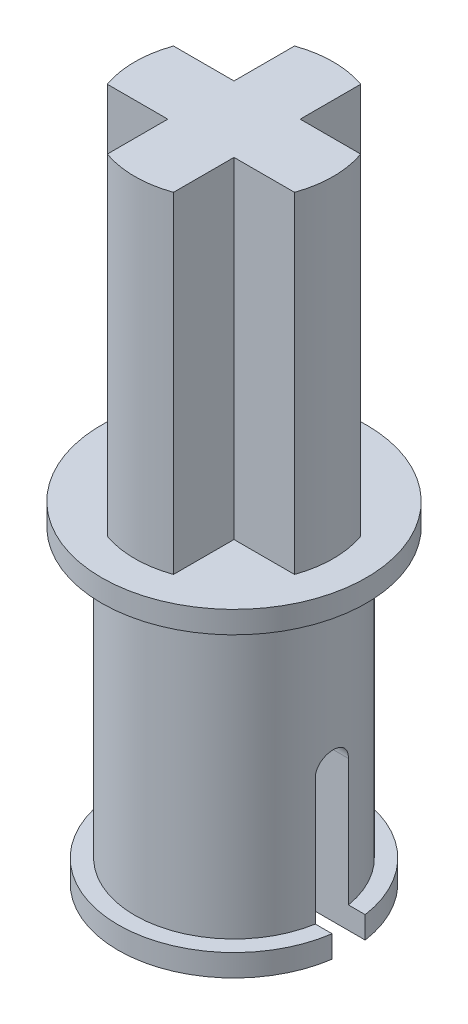
ISO-10303-21;
HEADER;
FILE_DESCRIPTION(('STEP AP214'),'2;1');
FILE_NAME('part.step','',(''),(''),'','','');
FILE_SCHEMA(('AUTOMOTIVE_DESIGN { 1 0 10303 214 1 1 1 1 }'));
ENDSEC;
DATA;
#1=APPLICATION_CONTEXT('core data for automotive mechanical design processes');
#2=APPLICATION_PROTOCOL_DEFINITION('international standard','automotive_design',2000,#1);
#3=PRODUCT_CONTEXT('',#1,'mechanical');
#4=PRODUCT('Part','Part','',(#3));
#5=PRODUCT_RELATED_PRODUCT_CATEGORY('part','',(#4));
#6=PRODUCT_DEFINITION_FORMATION('','',#4);
#7=PRODUCT_DEFINITION_CONTEXT('part definition',#1,'design');
#8=PRODUCT_DEFINITION('design','',#6,#7);
#9=PRODUCT_DEFINITION_SHAPE('','',#8);
#10=(LENGTH_UNIT() NAMED_UNIT(*) SI_UNIT(.MILLI.,.METRE.));
#11=(NAMED_UNIT(*) PLANE_ANGLE_UNIT() SI_UNIT($,.RADIAN.));
#12=(NAMED_UNIT(*) SI_UNIT($,.STERADIAN.) SOLID_ANGLE_UNIT());
#13=UNCERTAINTY_MEASURE_WITH_UNIT(LENGTH_MEASURE(1.E-05),#10,'distance_accuracy_value','');
#14=(GEOMETRIC_REPRESENTATION_CONTEXT(3) GLOBAL_UNCERTAINTY_ASSIGNED_CONTEXT((#13)) GLOBAL_UNIT_ASSIGNED_CONTEXT((#10,
#11,#12)) REPRESENTATION_CONTEXT('',''));
#15=CARTESIAN_POINT('',(0.,0.,0.));
#16=DIRECTION('',(0.,0.,1.));
#17=DIRECTION('',(1.,0.,0.));
#18=AXIS2_PLACEMENT_3D('',#15,#16,#17);
#19=CARTESIAN_POINT('',(0.,5.,0.));
#20=DIRECTION('',(0.,-1.,0.));
#21=DIRECTION('',(0.,0.,-1.));
#22=AXIS2_PLACEMENT_3D('',#19,#20,#21);
#23=CYLINDRICAL_SURFACE('',#22,1.5);
#24=CARTESIAN_POINT('',(0.,4.66666666666667,0.));
#25=DIRECTION('',(0.,1.,0.));
#26=DIRECTION('',(0.,0.,1.));
#27=AXIS2_PLACEMENT_3D('',#24,#25,#26);
#28=CIRCLE('',#27,1.5);
#29=CARTESIAN_POINT('',(0.,4.66666666666667,1.5));
#30=VERTEX_POINT('',#29);
#31=EDGE_CURVE('E418',#30,#30,#28,.T.);
#32=ORIENTED_EDGE('',*,*,#31,.F.);
#33=EDGE_LOOP('',(#32));
#34=FACE_BOUND('',#33,.T.);
#35=DIRECTION('',(0.,-1.,0.));
#36=VECTOR('',#35,1.);
#37=CARTESIAN_POINT('',(1.4790199457749,5.,0.250000000000003));
#38=LINE('',#37,#36);
#39=CARTESIAN_POINT('',(1.4790199457749,2.25,0.250000000000001));
#40=VERTEX_POINT('',#39);
#41=CARTESIAN_POINT('',(1.4790199457749,0.333333333333333,0.25));
#42=VERTEX_POINT('',#41);
#43=EDGE_CURVE('E342',#40,#42,#38,.T.);
#44=ORIENTED_EDGE('',*,*,#43,.F.);
#45=CARTESIAN_POINT('',(1.4790199457749,2.25,0.250000000000001));
#46=CARTESIAN_POINT('',(1.47901221872577,2.26396095683245,0.250012402551534));
#47=CARTESIAN_POINT('',(1.47921741048472,2.27791611938485,0.248831345018213));
#48=CARTESIAN_POINT('',(1.47999587227818,2.30541016199332,0.244176500369213));
#49=CARTESIAN_POINT('',(1.48056865919225,2.31894956403438,0.240705722404357));
#50=CARTESIAN_POINT('',(1.48202499235243,2.34524892864396,0.231564174181125));
#51=CARTESIAN_POINT('',(1.48290860685375,2.35800871929328,0.225892920688047));
#52=CARTESIAN_POINT('',(1.48488428816452,2.38239648919483,0.212519368982266));
#53=CARTESIAN_POINT('',(1.48597635768617,2.39402445371803,0.204817044343013));
#54=CARTESIAN_POINT('',(1.4882583756911,2.41593080757023,0.187519228628307));
#55=CARTESIAN_POINT('',(1.48944909400201,2.42619655698689,0.177907829040405));
#56=CARTESIAN_POINT('',(1.491787383604,2.44497851689128,0.157098237376144));
#57=CARTESIAN_POINT('',(1.49293494825854,2.45349445917116,0.145899802485204));
#58=CARTESIAN_POINT('',(1.49506576447851,2.46858167581452,0.122151951774289));
#59=CARTESIAN_POINT('',(1.49604799754859,2.47514107555226,0.109594892662244));
#60=CARTESIAN_POINT('',(1.49772877775239,2.4860523548294,0.0835387910448557));
#61=CARTESIAN_POINT('',(1.49842735944605,2.49040450331528,0.0700398635312756));
#62=CARTESIAN_POINT('',(1.49945672837495,2.49673921602822,0.0426145358003457));
#63=CARTESIAN_POINT('',(1.49979084515831,2.49874324410422,0.0286932203419586));
#64=CARTESIAN_POINT('',(1.50006508076469,2.50039158366326,0.000707863169417902));
#65=CARTESIAN_POINT('',(1.50000521702303,2.50003599956928,-0.0133561722012632));
#66=CARTESIAN_POINT('',(1.49950085758421,2.49699186011671,-0.0410802628902763));
#67=CARTESIAN_POINT('',(1.49906018069639,2.49432646686981,-0.0547429408470389));
#68=CARTESIAN_POINT('',(1.49784797400948,2.48677486104158,-0.0814242809166844));
#69=CARTESIAN_POINT('',(1.49707643624335,2.48188859498202,-0.0944429275130362));
#70=CARTESIAN_POINT('',(1.49528268120945,2.4700108264475,-0.119535849696669));
#71=CARTESIAN_POINT('',(1.49425932707671,2.46300974272845,-0.13160550541869));
#72=CARTESIAN_POINT('',(1.49207569682498,2.44710838032663,-0.154406950855712));
#73=CARTESIAN_POINT('',(1.49091541471556,2.43820801853899,-0.165138681995881));
#74=CARTESIAN_POINT('',(1.48857042314863,2.41863349651485,-0.185095754958703));
#75=CARTESIAN_POINT('',(1.48738558768296,2.40793931445142,-0.194301454502454));
#76=CARTESIAN_POINT('',(1.48513828313712,2.38514456844212,-0.210793395600476));
#77=CARTESIAN_POINT('',(1.48407584899365,2.37304360493252,-0.218079089892692));
#78=CARTESIAN_POINT('',(1.48219297916677,2.34775214208037,-0.230529023100573));
#79=CARTESIAN_POINT('',(1.48137295536583,2.33455983653606,-0.235689657078122));
#80=CARTESIAN_POINT('',(1.48007591486501,2.3074944232718,-0.243706410032311));
#81=CARTESIAN_POINT('',(1.47959838545312,2.29362236653597,-0.246565974481917));
#82=CARTESIAN_POINT('',(1.47911853225327,2.26978500932565,-0.249414284585125));
#83=CARTESIAN_POINT('',(1.47901686648485,2.25989054232892,-0.250005433378814));
#84=CARTESIAN_POINT('',(1.47901994577491,2.25,-0.25));
#85=B_SPLINE_CURVE_WITH_KNOTS('',3,(#45,#46,#47,#48,#49,#50,#51,#52,#53,#54,#55,#56,#57,#58,#59,
#60,#61,#62,#63,#64,#65,#66,#67,#68,#69,#70,#71,#72,#73,#74,#75,#76,#77,#78,#79,#80,#81,#82,#83,
#84),.UNSPECIFIED.,.F.,.F.,(4,2,2,2,2,2,2,2,2,2,2,2,2,2,2,2,2,2,2,4),(0.,0.0418228026426395,
0.083590750953894,0.125367876897847,0.167145546436639,0.209287179345357,0.251435266850383,
0.293834184215328,0.336227934166392,0.378231068338879,0.420232343704392,0.461817252795841,
0.503403163297524,0.54518038008816,0.586959425258929,0.629240298269244,0.671533209659102,
0.71389757379739,0.756198385617119,0.785863044728452),.UNSPECIFIED.);
#86=CARTESIAN_POINT('',(1.4790199457749,2.25,-0.25));
#87=VERTEX_POINT('',#86);
#88=EDGE_CURVE('E350',#40,#87,#85,.T.);
#89=ORIENTED_EDGE('',*,*,#88,.T.);
#90=DIRECTION('',(0.,-1.,0.));
#91=VECTOR('',#90,1.);
#92=CARTESIAN_POINT('',(1.4790199457749,5.,-0.25));
#93=LINE('',#92,#91);
#94=CARTESIAN_POINT('',(1.4790199457749,0.333333333333333,-0.25));
#95=VERTEX_POINT('',#94);
#96=EDGE_CURVE('E322',#87,#95,#93,.T.);
#97=ORIENTED_EDGE('',*,*,#96,.T.);
#98=CARTESIAN_POINT('',(0.,0.333333333333333,0.));
#99=DIRECTION('',(0.,-1.,0.));
#100=DIRECTION('',(0.,0.,-1.));
#101=AXIS2_PLACEMENT_3D('',#98,#99,#100);
#102=CIRCLE('',#101,1.5);
#103=CARTESIAN_POINT('',(-1.4790199457749,0.333333333333333,-0.25));
#104=VERTEX_POINT('',#103);
#105=EDGE_CURVE('E443',#104,#95,#102,.T.);
#106=ORIENTED_EDGE('',*,*,#105,.F.);
#107=DIRECTION('',(0.,-1.,0.));
#108=VECTOR('',#107,1.);
#109=CARTESIAN_POINT('',(-1.4790199457749,5.,-0.25));
#110=LINE('',#109,#108);
#111=CARTESIAN_POINT('',(-1.4790199457749,2.25,-0.25));
#112=VERTEX_POINT('',#111);
#113=EDGE_CURVE('E316',#104,#112,#110,.F.);
#114=ORIENTED_EDGE('',*,*,#113,.T.);
#115=CARTESIAN_POINT('',(-1.4790199457749,2.25,-0.25));
#116=CARTESIAN_POINT('',(-1.47901221872577,2.26396095683244,-0.250012402551532));
#117=CARTESIAN_POINT('',(-1.47921741048472,2.27791611938485,-0.248831345018212));
#118=CARTESIAN_POINT('',(-1.47999587227818,2.30541016199332,-0.244176500369212));
#119=CARTESIAN_POINT('',(-1.48056865919225,2.31894956403438,-0.240705722404356));
#120=CARTESIAN_POINT('',(-1.48202499235243,2.34524892864396,-0.231564174181124));
#121=CARTESIAN_POINT('',(-1.48290860685375,2.35800871929328,-0.225892920688045));
#122=CARTESIAN_POINT('',(-1.48488428816452,2.38239648919483,-0.212519368982264));
#123=CARTESIAN_POINT('',(-1.48597635768617,2.39402445371803,-0.204817044343012));
#124=CARTESIAN_POINT('',(-1.4882583756911,2.41593080757023,-0.187519228628305));
#125=CARTESIAN_POINT('',(-1.48944909400201,2.42619655698689,-0.177907829040403));
#126=CARTESIAN_POINT('',(-1.491787383604,2.44497851689128,-0.157098237376143));
#127=CARTESIAN_POINT('',(-1.49293494825854,2.45349445917116,-0.145899802485202));
#128=CARTESIAN_POINT('',(-1.49506576447851,2.46858167581452,-0.122151951774287));
#129=CARTESIAN_POINT('',(-1.49604799754859,2.47514107555226,-0.109594892662243));
#130=CARTESIAN_POINT('',(-1.49772877775239,2.4860523548294,-0.0835387910448543));
#131=CARTESIAN_POINT('',(-1.49842735944605,2.49040450331528,-0.0700398635312742));
#132=CARTESIAN_POINT('',(-1.49945672837495,2.49673921602822,-0.0426145358003443));
#133=CARTESIAN_POINT('',(-1.49979084515831,2.49874324410422,-0.0286932203419571));
#134=CARTESIAN_POINT('',(-1.50006508076469,2.50039158366326,-0.000707863169416467));
#135=CARTESIAN_POINT('',(-1.50000521702303,2.50003599956928,0.0133561722012646));
#136=CARTESIAN_POINT('',(-1.49950085758421,2.49699186011671,0.0410802628902777));
#137=CARTESIAN_POINT('',(-1.49906018069639,2.49432646686981,0.0547429408470403));
#138=CARTESIAN_POINT('',(-1.49784797400948,2.48677486104158,0.0814242809166857));
#139=CARTESIAN_POINT('',(-1.49707643624335,2.48188859498202,0.0944429275130376));
#140=CARTESIAN_POINT('',(-1.49528268120945,2.4700108264475,0.11953584969667));
#141=CARTESIAN_POINT('',(-1.49425932707671,2.46300974272845,0.131605505418692));
#142=CARTESIAN_POINT('',(-1.49207569682498,2.44710838032663,0.154406950855713));
#143=CARTESIAN_POINT('',(-1.49091541471556,2.43820801853899,0.165138681995883));
#144=CARTESIAN_POINT('',(-1.48857042314863,2.41863349651485,0.185095754958704));
#145=CARTESIAN_POINT('',(-1.48738558768296,2.40793931445142,0.194301454502455));
#146=CARTESIAN_POINT('',(-1.48513828313712,2.38514456844212,0.210793395600477));
#147=CARTESIAN_POINT('',(-1.48407584899365,2.37304360493252,0.218079089892694));
#148=CARTESIAN_POINT('',(-1.48219297916677,2.34775214208037,0.230529023100574));
#149=CARTESIAN_POINT('',(-1.48137295536583,2.33455983653606,0.235689657078123));
#150=CARTESIAN_POINT('',(-1.48007591486501,2.3074944232718,0.243706410032312));
#151=CARTESIAN_POINT('',(-1.47959838545312,2.29362236653597,0.246565974481918));
#152=CARTESIAN_POINT('',(-1.47911853225327,2.26978500932565,0.249414284585126));
#153=CARTESIAN_POINT('',(-1.47901686648485,2.25989054232892,0.250005433378815));
#154=CARTESIAN_POINT('',(-1.47901994577491,2.25,0.250000000000002));
#155=B_SPLINE_CURVE_WITH_KNOTS('',3,(#115,#116,#117,#118,#119,#120,#121,#122,#123,#124,#125,
#126,#127,#128,#129,#130,#131,#132,#133,#134,#135,#136,#137,#138,#139,#140,#141,#142,#143,#144,
#145,#146,#147,#148,#149,#150,#151,#152,#153,#154),.UNSPECIFIED.,.F.,.F.,(4,2,2,2,2,2,2,2,2,2,2,
2,2,2,2,2,2,2,2,4),(0.,0.0418228026426391,0.083590750953894,0.125367876897847,0.167145546436639,
0.209287179345357,0.251435266850383,0.293834184215328,0.336227934166392,0.378231068338879,
0.420232343704392,0.461817252795841,0.503403163297524,0.54518038008816,0.586959425258928,
0.629240298269243,0.671533209659102,0.71389757379739,0.756198385617119,0.785863044728452),.UNSPECIFIED.);
#156=CARTESIAN_POINT('',(-1.4790199457749,2.25,0.250000000000001));
#157=VERTEX_POINT('',#156);
#158=EDGE_CURVE('E344',#112,#157,#155,.T.);
#159=ORIENTED_EDGE('',*,*,#158,.T.);
#160=DIRECTION('',(0.,-1.,0.));
#161=VECTOR('',#160,1.);
#162=CARTESIAN_POINT('',(-1.4790199457749,5.,0.250000000000003));
#163=LINE('',#162,#161);
#164=CARTESIAN_POINT('',(-1.4790199457749,0.333333333333333,0.25));
#165=VERTEX_POINT('',#164);
#166=EDGE_CURVE('E336',#165,#157,#163,.F.);
#167=ORIENTED_EDGE('',*,*,#166,.F.);
#168=EDGE_CURVE('E424',#42,#165,#102,.T.);
#169=ORIENTED_EDGE('',*,*,#168,.F.);
#170=EDGE_LOOP('',(#44,#89,#97,#106,#114,#159,#167,#169));
#171=FACE_BOUND('',#170,.T.);
#172=ADVANCED_FACE('F35',(#34,#171),#23,.T.);
#173=CARTESIAN_POINT('',(0.,0.333333333333333,0.));
#174=DIRECTION('',(0.,-1.,0.));
#175=DIRECTION('',(0.,0.,-1.));
#176=AXIS2_PLACEMENT_3D('',#173,#174,#175);
#177=PLANE('',#176);
#178=DIRECTION('',(1.,0.,0.));
#179=VECTOR('',#178,1.);
#180=CARTESIAN_POINT('',(0.,0.333333333333333,0.25));
#181=LINE('',#180,#179);
#182=CARTESIAN_POINT('',(-1.73205080756888,0.333333333333333,0.25));
#183=VERTEX_POINT('',#182);
#184=EDGE_CURVE('E334',#183,#165,#181,.T.);
#185=ORIENTED_EDGE('',*,*,#184,.F.);
#186=CARTESIAN_POINT('',(0.,0.333333333333333,0.));
#187=DIRECTION('',(0.,-1.,0.));
#188=DIRECTION('',(0.,0.,-1.));
#189=AXIS2_PLACEMENT_3D('',#186,#187,#188);
#190=CIRCLE('',#189,1.75);
#191=CARTESIAN_POINT('',(1.73205080756888,0.333333333333333,0.25));
#192=VERTEX_POINT('',#191);
#193=EDGE_CURVE('E431',#192,#183,#190,.T.);
#194=ORIENTED_EDGE('',*,*,#193,.F.);
#195=EDGE_CURVE('E337',#42,#192,#181,.T.);
#196=ORIENTED_EDGE('',*,*,#195,.F.);
#197=ORIENTED_EDGE('',*,*,#168,.T.);
#198=EDGE_LOOP('',(#185,#194,#196,#197));
#199=FACE_BOUND('',#198,.T.);
#200=ADVANCED_FACE('F408',(#199),#177,.F.);
#201=CARTESIAN_POINT('',(0.,0.333333333333333,0.));
#202=DIRECTION('',(0.,-1.,0.));
#203=DIRECTION('',(0.,0.,-1.));
#204=AXIS2_PLACEMENT_3D('',#201,#202,#203);
#205=CYLINDRICAL_SURFACE('',#204,1.75);
#206=CARTESIAN_POINT('',(0.,0.,0.));
#207=DIRECTION('',(0.,-1.,0.));
#208=DIRECTION('',(0.,0.,-1.));
#209=AXIS2_PLACEMENT_3D('',#206,#207,#208);
#210=CIRCLE('',#209,1.75);
#211=CARTESIAN_POINT('',(1.73205080756888,0.,0.25));
#212=VERTEX_POINT('',#211);
#213=CARTESIAN_POINT('',(-1.73205080756888,0.,0.25));
#214=VERTEX_POINT('',#213);
#215=EDGE_CURVE('E439',#212,#214,#210,.T.);
#216=ORIENTED_EDGE('',*,*,#215,.F.);
#217=DIRECTION('',(0.,-1.,0.));
#218=VECTOR('',#217,1.);
#219=CARTESIAN_POINT('',(1.73205080756888,0.333333333333333,0.25));
#220=LINE('',#219,#218);
#221=EDGE_CURVE('E339',#212,#192,#220,.F.);
#222=ORIENTED_EDGE('',*,*,#221,.T.);
#223=ORIENTED_EDGE('',*,*,#193,.T.);
#224=DIRECTION('',(0.,-1.,0.));
#225=VECTOR('',#224,1.);
#226=CARTESIAN_POINT('',(-1.73205080756888,0.333333333333333,0.25));
#227=LINE('',#226,#225);
#228=EDGE_CURVE('E331',#183,#214,#227,.T.);
#229=ORIENTED_EDGE('',*,*,#228,.T.);
#230=EDGE_LOOP('',(#216,#222,#223,#229));
#231=FACE_BOUND('',#230,.T.);
#232=ADVANCED_FACE('F382',(#231),#205,.T.);
#233=CARTESIAN_POINT('',(0.,5.,0.));
#234=DIRECTION('',(0.,-1.,0.));
#235=DIRECTION('',(0.,0.,-1.));
#236=AXIS2_PLACEMENT_3D('',#233,#234,#235);
#237=CYLINDRICAL_SURFACE('',#236,1.);
#238=CARTESIAN_POINT('',(0.,4.66666666666667,0.));
#239=DIRECTION('',(0.,1.,0.));
#240=DIRECTION('',(0.,0.,1.));
#241=AXIS2_PLACEMENT_3D('',#238,#239,#240);
#242=CIRCLE('',#241,1.);
#243=CARTESIAN_POINT('',(0.,4.66666666666667,1.));
#244=VERTEX_POINT('',#243);
#245=EDGE_CURVE('E447',#244,#244,#242,.T.);
#246=ORIENTED_EDGE('',*,*,#245,.T.);
#247=EDGE_LOOP('',(#246));
#248=FACE_BOUND('',#247,.T.);
#249=CARTESIAN_POINT('',(0.968245836551854,2.25,0.250000000000001));
#250=CARTESIAN_POINT('',(0.968234049545617,2.26383070607813,0.250012953215812));
#251=CARTESIAN_POINT('',(0.968541877962347,2.27765275214075,0.248853161388951));
#252=CARTESIAN_POINT('',(0.969707324249105,2.30486994361927,0.244289832798707));
#253=CARTESIAN_POINT('',(0.970563824163099,2.31826589909795,0.240890858126017));
#254=CARTESIAN_POINT('',(0.9727377402555,2.344279386634,0.231950584629504));
#255=CARTESIAN_POINT('',(0.974055113119327,2.35689699171264,0.226409487125331));
#256=CARTESIAN_POINT('',(0.976998055593671,2.38102834005615,0.213353558724009));
#257=CARTESIAN_POINT('',(0.978623707814904,2.39254178618752,0.205838198568215));
#258=CARTESIAN_POINT('',(0.982040595501114,2.41438583871804,0.18887119674902));
#259=CARTESIAN_POINT('',(0.983834461354369,2.42468868623804,0.17938433831947));
#260=CARTESIAN_POINT('',(0.987362777210994,2.44357555769966,0.158818924002211));
#261=CARTESIAN_POINT('',(0.989097217680292,2.45215930689364,0.147740114172738));
#262=CARTESIAN_POINT('',(0.992340451273177,2.46747774074516,0.124114230626838));
#263=CARTESIAN_POINT('',(0.993845760516911,2.47418497140975,0.111548836630203));
#264=CARTESIAN_POINT('',(0.996430866813653,2.48538118613491,0.0854256461644529));
#265=CARTESIAN_POINT('',(0.997510747601812,2.48987060676118,0.0718680456103894));
#266=CARTESIAN_POINT('',(0.999104749704138,2.49641474752203,0.0444360275333476));
#267=CARTESIAN_POINT('',(0.999629882170623,2.4985169179257,0.030573580608359));
#268=CARTESIAN_POINT('',(1.00009359545966,2.50037584306581,0.00268319381279078));
#269=CARTESIAN_POINT('',(1.00003225000546,2.50013289259581,-0.0113447250357131));
#270=CARTESIAN_POINT('',(0.999338093392974,2.49734250903197,-0.0388381232151192));
#271=CARTESIAN_POINT('',(0.99871799668788,2.49484634583761,-0.0523091754274905));
#272=CARTESIAN_POINT('',(0.996990826596762,2.48770283021684,-0.0786346777785571));
#273=CARTESIAN_POINT('',(0.995883731664611,2.48305538261128,-0.0914891006079816));
#274=CARTESIAN_POINT('',(0.993287494403769,2.47169967982888,-0.116351821504131));
#275=CARTESIAN_POINT('',(0.991794984571589,2.46497315144064,-0.128351407400121));
#276=CARTESIAN_POINT('',(0.988589863852097,2.44966421754278,-0.151069157807944));
#277=CARTESIAN_POINT('',(0.986877219821464,2.44108153243782,-0.161787128890331));
#278=CARTESIAN_POINT('',(0.983363915069006,2.42203027197852,-0.181942347427369));
#279=CARTESIAN_POINT('',(0.981562126239374,2.41151709086156,-0.191337275764997));
#280=CARTESIAN_POINT('',(0.978115420664843,2.38904253327155,-0.208242393795092));
#281=CARTESIAN_POINT('',(0.976470546938616,2.37708076169189,-0.215752067555646));
#282=CARTESIAN_POINT('',(0.973519534135929,2.3519636005341,-0.228701177325652));
#283=CARTESIAN_POINT('',(0.972215265658711,2.338802133734,-0.234129254490506));
#284=CARTESIAN_POINT('',(0.970117647619827,2.31172076785364,-0.242675587980693));
#285=CARTESIAN_POINT('',(0.969323534507774,2.29780203620287,-0.24579729730641));
#286=CARTESIAN_POINT('',(0.968638226662377,2.27813565481264,-0.248476158786593));
#287=CARTESIAN_POINT('',(0.968491307756439,2.27252007419789,-0.249047697741106));
#288=CARTESIAN_POINT('',(0.968295156243113,2.26127055252149,-0.249809189424918));
#289=CARTESIAN_POINT('',(0.968245765589992,2.25563665600881,-0.249999759525152));
#290=CARTESIAN_POINT('',(0.968245836551973,2.25,-0.250000000000009));
#291=B_SPLINE_CURVE_WITH_KNOTS('',3,(#249,#250,#251,#252,#253,#254,#255,#256,#257,#258,#259,
#260,#261,#262,#263,#264,#265,#266,#267,#268,#269,#270,#271,#272,#273,#274,#275,#276,#277,#278,
#279,#280,#281,#282,#283,#284,#285,#286,#287,#288,#289,#290),.UNSPECIFIED.,.F.,.F.,(4,2,2,2,2,2,
2,2,2,2,2,2,2,2,2,2,2,2,2,2,4),(0.,0.0414268569974913,0.0827695712464079,0.124108400994361,
0.165458324149683,0.207622554824989,0.249793518852794,0.292552548213583,0.335303157299057,
0.377188284256308,0.419068146109594,0.460018444166185,0.500970554157592,0.542293354093937,
0.583622382878818,0.626065654304352,0.668520528420415,0.711203880860888,0.753823199296981,
0.770751702253638,0.787652749776197),.UNSPECIFIED.);
#292=CARTESIAN_POINT('',(0.968245836551853,2.25,0.250000000000001));
#293=VERTEX_POINT('',#292);
#294=CARTESIAN_POINT('',(0.968245836551854,2.25,-0.25));
#295=VERTEX_POINT('',#294);
#296=EDGE_CURVE('E11',#293,#295,#291,.T.);
#297=ORIENTED_EDGE('',*,*,#296,.F.);
#298=DIRECTION('',(0.,-1.,0.));
#299=VECTOR('',#298,1.);
#300=CARTESIAN_POINT('',(0.968245836551853,5.,0.250000000000003));
#301=LINE('',#300,#299);
#302=CARTESIAN_POINT('',(0.968245836551854,0.,0.25));
#303=VERTEX_POINT('',#302);
#304=EDGE_CURVE('E328',#293,#303,#301,.T.);
#305=ORIENTED_EDGE('',*,*,#304,.T.);
#306=CARTESIAN_POINT('',(0.,0.,0.));
#307=DIRECTION('',(0.,1.,0.));
#308=DIRECTION('',(0.,0.,1.));
#309=AXIS2_PLACEMENT_3D('',#306,#307,#308);
#310=CIRCLE('',#309,1.);
#311=CARTESIAN_POINT('',(-0.968245836551854,0.,0.25));
#312=VERTEX_POINT('',#311);
#313=EDGE_CURVE('E451',#312,#303,#310,.T.);
#314=ORIENTED_EDGE('',*,*,#313,.F.);
#315=DIRECTION('',(0.,-1.,0.));
#316=VECTOR('',#315,1.);
#317=CARTESIAN_POINT('',(-0.968245836551853,5.,0.250000000000003));
#318=LINE('',#317,#316);
#319=CARTESIAN_POINT('',(-0.968245836551853,2.25,0.250000000000001));
#320=VERTEX_POINT('',#319);
#321=EDGE_CURVE('E325',#312,#320,#318,.F.);
#322=ORIENTED_EDGE('',*,*,#321,.T.);
#323=CARTESIAN_POINT('',(-0.968245836551854,2.25,-0.25));
#324=CARTESIAN_POINT('',(-0.968234049545618,2.26383070607813,-0.250012953215811));
#325=CARTESIAN_POINT('',(-0.968541877962347,2.27765275214075,-0.24885316138895));
#326=CARTESIAN_POINT('',(-0.969707324249105,2.30486994361927,-0.244289832798706));
#327=CARTESIAN_POINT('',(-0.970563824163099,2.31826589909795,-0.240890858126015));
#328=CARTESIAN_POINT('',(-0.9727377402555,2.344279386634,-0.231950584629502));
#329=CARTESIAN_POINT('',(-0.974055113119327,2.35689699171264,-0.22640948712533));
#330=CARTESIAN_POINT('',(-0.976998055593672,2.38102834005615,-0.213353558724008));
#331=CARTESIAN_POINT('',(-0.978623707814904,2.39254178618752,-0.205838198568213));
#332=CARTESIAN_POINT('',(-0.982040595501114,2.41438583871804,-0.188871196749019));
#333=CARTESIAN_POINT('',(-0.983834461354369,2.42468868623804,-0.179384338319469));
#334=CARTESIAN_POINT('',(-0.987362777210994,2.44357555769966,-0.15881892400221));
#335=CARTESIAN_POINT('',(-0.989097217680292,2.45215930689364,-0.147740114172737));
#336=CARTESIAN_POINT('',(-0.992340451273177,2.46747774074516,-0.124114230626837));
#337=CARTESIAN_POINT('',(-0.993845760516911,2.47418497140975,-0.111548836630201));
#338=CARTESIAN_POINT('',(-0.996430866813653,2.48538118613491,-0.0854256461644516));
#339=CARTESIAN_POINT('',(-0.997510747601812,2.48987060676118,-0.071868045610388));
#340=CARTESIAN_POINT('',(-0.999104749704139,2.49641474752203,-0.0444360275333462));
#341=CARTESIAN_POINT('',(-0.999629882170623,2.4985169179257,-0.0305735806083575));
#342=CARTESIAN_POINT('',(-1.00009359545966,2.50037584306581,-0.00268319381278935));
#343=CARTESIAN_POINT('',(-1.00003225000546,2.50013289259581,0.0113447250357145));
#344=CARTESIAN_POINT('',(-0.999338093392974,2.49734250903197,0.0388381232151207));
#345=CARTESIAN_POINT('',(-0.99871799668788,2.49484634583761,0.052309175427492));
#346=CARTESIAN_POINT('',(-0.996990826596762,2.48770283021684,0.0786346777785586));
#347=CARTESIAN_POINT('',(-0.995883731664611,2.48305538261128,0.091489100607983));
#348=CARTESIAN_POINT('',(-0.993287494403768,2.47169967982888,0.116351821504132));
#349=CARTESIAN_POINT('',(-0.991794984571589,2.46497315144064,0.128351407400122));
#350=CARTESIAN_POINT('',(-0.988589863852097,2.44966421754278,0.151069157807945));
#351=CARTESIAN_POINT('',(-0.986877219821464,2.44108153243782,0.161787128890333));
#352=CARTESIAN_POINT('',(-0.983363915069006,2.42203027197852,0.18194234742737));
#353=CARTESIAN_POINT('',(-0.981562126239374,2.41151709086156,0.191337275764998));
#354=CARTESIAN_POINT('',(-0.978115420664843,2.38904253327155,0.208242393795094));
#355=CARTESIAN_POINT('',(-0.976470546938616,2.37708076169189,0.215752067555647));
#356=CARTESIAN_POINT('',(-0.973519534135928,2.3519636005341,0.228701177325654));
#357=CARTESIAN_POINT('',(-0.972215265658711,2.338802133734,0.234129254490508));
#358=CARTESIAN_POINT('',(-0.970117647619827,2.31172076785364,0.242675587980694));
#359=CARTESIAN_POINT('',(-0.969323534507774,2.29780203620287,0.245797297306411));
#360=CARTESIAN_POINT('',(-0.968638226662376,2.27813565481264,0.248476158786595));
#361=CARTESIAN_POINT('',(-0.968491307756439,2.27252007419789,0.249047697741108));
#362=CARTESIAN_POINT('',(-0.968295156243113,2.26127055252149,0.24980918942492));
#363=CARTESIAN_POINT('',(-0.968245765589992,2.25563665600881,0.249999759525153));
#364=CARTESIAN_POINT('',(-0.968245836551973,2.25,0.25000000000001));
#365=B_SPLINE_CURVE_WITH_KNOTS('',3,(#323,#324,#325,#326,#327,#328,#329,#330,#331,#332,#333,
#334,#335,#336,#337,#338,#339,#340,#341,#342,#343,#344,#345,#346,#347,#348,#349,#350,#351,#352,
#353,#354,#355,#356,#357,#358,#359,#360,#361,#362,#363,#364),.UNSPECIFIED.,.F.,.F.,(4,2,2,2,2,2,
2,2,2,2,2,2,2,2,2,2,2,2,2,2,4),(0.,0.0414268569974913,0.0827695712464079,0.124108400994361,
0.165458324149683,0.207622554824989,0.249793518852794,0.292552548213582,0.335303157299057,
0.377188284256308,0.419068146109593,0.460018444166185,0.500970554157592,0.542293354093937,
0.583622382878818,0.626065654304352,0.668520528420415,0.711203880860888,0.753823199296981,
0.770751702253638,0.787652749776197),.UNSPECIFIED.);
#366=CARTESIAN_POINT('',(-0.968245836551854,2.25,-0.25));
#367=VERTEX_POINT('',#366);
#368=EDGE_CURVE('E48',#367,#320,#365,.T.);
#369=ORIENTED_EDGE('',*,*,#368,.F.);
#370=DIRECTION('',(0.,-1.,0.));
#371=VECTOR('',#370,1.);
#372=CARTESIAN_POINT('',(-0.968245836551854,5.,-0.25));
#373=LINE('',#372,#371);
#374=CARTESIAN_POINT('',(-0.968245836551854,0.,-0.25));
#375=VERTEX_POINT('',#374);
#376=EDGE_CURVE('E307',#375,#367,#373,.F.);
#377=ORIENTED_EDGE('',*,*,#376,.F.);
#378=CARTESIAN_POINT('',(0.968245836551854,0.,-0.25));
#379=VERTEX_POINT('',#378);
#380=EDGE_CURVE('E450',#379,#375,#310,.T.);
#381=ORIENTED_EDGE('',*,*,#380,.F.);
#382=DIRECTION('',(0.,-1.,0.));
#383=VECTOR('',#382,1.);
#384=CARTESIAN_POINT('',(0.968245836551854,5.,-0.25));
#385=LINE('',#384,#383);
#386=EDGE_CURVE('E309',#295,#379,#385,.T.);
#387=ORIENTED_EDGE('',*,*,#386,.F.);
#388=EDGE_LOOP('',(#297,#305,#314,#322,#369,#377,#381,#387));
#389=FACE_BOUND('',#388,.T.);
#390=ADVANCED_FACE('F376',(#248,#389),#237,.F.);
#391=CARTESIAN_POINT('',(0.,0.,0.));
#392=DIRECTION('',(0.,1.,0.));
#393=DIRECTION('',(0.,0.,1.));
#394=AXIS2_PLACEMENT_3D('',#391,#392,#393);
#395=PLANE('',#394);
#396=DIRECTION('',(-1.,0.,0.));
#397=VECTOR('',#396,1.);
#398=CARTESIAN_POINT('',(0.,0.,0.25));
#399=LINE('',#398,#397);
#400=EDGE_CURVE('E373',#212,#303,#399,.T.);
#401=ORIENTED_EDGE('',*,*,#400,.F.);
#402=ORIENTED_EDGE('',*,*,#215,.T.);
#403=EDGE_CURVE('E374',#312,#214,#399,.T.);
#404=ORIENTED_EDGE('',*,*,#403,.F.);
#405=ORIENTED_EDGE('',*,*,#313,.T.);
#406=EDGE_LOOP('',(#401,#402,#404,#405));
#407=FACE_BOUND('',#406,.T.);
#408=ADVANCED_FACE('F381',(#407),#395,.F.);
#409=CARTESIAN_POINT('',(0.,4.66666666666667,0.));
#410=DIRECTION('',(0.,1.,0.));
#411=DIRECTION('',(0.,0.,1.));
#412=AXIS2_PLACEMENT_3D('',#409,#410,#411);
#413=CYLINDRICAL_SURFACE('',#412,2.);
#414=CARTESIAN_POINT('',(0.,4.66666666666667,0.));
#415=DIRECTION('',(0.,1.,0.));
#416=DIRECTION('',(0.,0.,1.));
#417=AXIS2_PLACEMENT_3D('',#414,#415,#416);
#418=CIRCLE('',#417,2.);
#419=CARTESIAN_POINT('',(0.,4.66666666666667,2.));
#420=VERTEX_POINT('',#419);
#421=EDGE_CURVE('E436',#420,#420,#418,.T.);
#422=ORIENTED_EDGE('',*,*,#421,.T.);
#423=EDGE_LOOP('',(#422));
#424=FACE_BOUND('',#423,.T.);
#425=CARTESIAN_POINT('',(0.,5.,0.));
#426=DIRECTION('',(0.,1.,0.));
#427=DIRECTION('',(0.,0.,1.));
#428=AXIS2_PLACEMENT_3D('',#425,#426,#427);
#429=CIRCLE('',#428,2.);
#430=CARTESIAN_POINT('',(0.,5.,2.));
#431=VERTEX_POINT('',#430);
#432=EDGE_CURVE('E433',#431,#431,#429,.T.);
#433=ORIENTED_EDGE('',*,*,#432,.F.);
#434=EDGE_LOOP('',(#433));
#435=FACE_BOUND('',#434,.T.);
#436=ADVANCED_FACE('F384',(#424,#435),#413,.T.);
#437=CARTESIAN_POINT('',(0.,4.66666666666667,0.));
#438=DIRECTION('',(0.,1.,0.));
#439=DIRECTION('',(0.,0.,1.));
#440=AXIS2_PLACEMENT_3D('',#437,#438,#439);
#441=PLANE('',#440);
#442=ORIENTED_EDGE('',*,*,#31,.T.);
#443=EDGE_LOOP('',(#442));
#444=FACE_BOUND('',#443,.T.);
#445=ORIENTED_EDGE('',*,*,#421,.F.);
#446=EDGE_LOOP('',(#445));
#447=FACE_BOUND('',#446,.T.);
#448=ADVANCED_FACE('F390',(#444,#447),#441,.F.);
#449=CARTESIAN_POINT('',(0.,5.,0.));
#450=DIRECTION('',(0.,1.,0.));
#451=DIRECTION('',(0.,0.,1.));
#452=AXIS2_PLACEMENT_3D('',#449,#450,#451);
#453=PLANE('',#452);
#454=DIRECTION('',(-1.,0.,0.));
#455=VECTOR('',#454,1.);
#456=CARTESIAN_POINT('',(0.,5.,0.5));
#457=LINE('',#456,#455);
#458=CARTESIAN_POINT('',(1.41421356237309,5.,0.5));
#459=VERTEX_POINT('',#458);
#460=CARTESIAN_POINT('',(0.5,5.,0.5));
#461=VERTEX_POINT('',#460);
#462=EDGE_CURVE('E205',#459,#461,#457,.T.);
#463=ORIENTED_EDGE('',*,*,#462,.T.);
#464=DIRECTION('',(0.,0.,1.));
#465=VECTOR('',#464,1.);
#466=CARTESIAN_POINT('',(0.5,5.,0.));
#467=LINE('',#466,#465);
#468=CARTESIAN_POINT('',(0.5,5.,1.4142135623731));
#469=VERTEX_POINT('',#468);
#470=EDGE_CURVE('E221',#461,#469,#467,.T.);
#471=ORIENTED_EDGE('',*,*,#470,.T.);
#472=CARTESIAN_POINT('',(0.,5.,0.));
#473=DIRECTION('',(0.,1.,0.));
#474=DIRECTION('',(0.,0.,1.));
#475=AXIS2_PLACEMENT_3D('',#472,#473,#474);
#476=CIRCLE('',#475,1.5);
#477=CARTESIAN_POINT('',(-0.5,5.,1.4142135623731));
#478=VERTEX_POINT('',#477);
#479=EDGE_CURVE('E223',#478,#469,#476,.T.);
#480=ORIENTED_EDGE('',*,*,#479,.F.);
#481=DIRECTION('',(0.,0.,1.));
#482=VECTOR('',#481,1.);
#483=CARTESIAN_POINT('',(-0.5,5.,0.));
#484=LINE('',#483,#482);
#485=CARTESIAN_POINT('',(-0.5,5.,0.5));
#486=VERTEX_POINT('',#485);
#487=EDGE_CURVE('E266',#486,#478,#484,.T.);
#488=ORIENTED_EDGE('',*,*,#487,.F.);
#489=DIRECTION('',(-1.,0.,0.));
#490=VECTOR('',#489,1.);
#491=CARTESIAN_POINT('',(0.,5.,0.5));
#492=LINE('',#491,#490);
#493=CARTESIAN_POINT('',(-1.4142135623731,5.,0.500000000000001));
#494=VERTEX_POINT('',#493);
#495=EDGE_CURVE('E264',#486,#494,#492,.T.);
#496=ORIENTED_EDGE('',*,*,#495,.T.);
#497=CARTESIAN_POINT('',(0.,5.,0.));
#498=DIRECTION('',(0.,1.,0.));
#499=DIRECTION('',(0.,0.,1.));
#500=AXIS2_PLACEMENT_3D('',#497,#498,#499);
#501=CIRCLE('',#500,1.5);
#502=CARTESIAN_POINT('',(-1.4142135623731,5.,-0.5));
#503=VERTEX_POINT('',#502);
#504=EDGE_CURVE('E261',#503,#494,#501,.T.);
#505=ORIENTED_EDGE('',*,*,#504,.F.);
#506=DIRECTION('',(-1.,0.,0.));
#507=VECTOR('',#506,1.);
#508=CARTESIAN_POINT('',(0.,5.,-0.5));
#509=LINE('',#508,#507);
#510=CARTESIAN_POINT('',(-0.5,5.,-0.5));
#511=VERTEX_POINT('',#510);
#512=EDGE_CURVE('E258',#511,#503,#509,.T.);
#513=ORIENTED_EDGE('',*,*,#512,.F.);
#514=DIRECTION('',(0.,0.,1.));
#515=VECTOR('',#514,1.);
#516=CARTESIAN_POINT('',(-0.5,5.,0.));
#517=LINE('',#516,#515);
#518=CARTESIAN_POINT('',(-0.5,5.,-1.41421356237309));
#519=VERTEX_POINT('',#518);
#520=EDGE_CURVE('E255',#519,#511,#517,.T.);
#521=ORIENTED_EDGE('',*,*,#520,.F.);
#522=CARTESIAN_POINT('',(0.,5.,0.));
#523=DIRECTION('',(0.,1.,0.));
#524=DIRECTION('',(0.,0.,1.));
#525=AXIS2_PLACEMENT_3D('',#522,#523,#524);
#526=CIRCLE('',#525,1.5);
#527=CARTESIAN_POINT('',(0.5,5.,-1.41421356237309));
#528=VERTEX_POINT('',#527);
#529=EDGE_CURVE('E252',#528,#519,#526,.T.);
#530=ORIENTED_EDGE('',*,*,#529,.F.);
#531=DIRECTION('',(0.,0.,1.));
#532=VECTOR('',#531,1.);
#533=CARTESIAN_POINT('',(0.5,5.,0.));
#534=LINE('',#533,#532);
#535=CARTESIAN_POINT('',(0.5,5.,-0.5));
#536=VERTEX_POINT('',#535);
#537=EDGE_CURVE('E250',#528,#536,#534,.T.);
#538=ORIENTED_EDGE('',*,*,#537,.T.);
#539=DIRECTION('',(-1.,0.,0.));
#540=VECTOR('',#539,1.);
#541=CARTESIAN_POINT('',(0.,5.,-0.5));
#542=LINE('',#541,#540);
#543=CARTESIAN_POINT('',(1.41421356237309,5.,-0.5));
#544=VERTEX_POINT('',#543);
#545=EDGE_CURVE('E60',#544,#536,#542,.T.);
#546=ORIENTED_EDGE('',*,*,#545,.F.);
#547=CARTESIAN_POINT('',(0.,5.,0.));
#548=DIRECTION('',(0.,1.,0.));
#549=DIRECTION('',(0.,0.,1.));
#550=AXIS2_PLACEMENT_3D('',#547,#548,#549);
#551=CIRCLE('',#550,1.5);
#552=EDGE_CURVE('E55',#459,#544,#551,.T.);
#553=ORIENTED_EDGE('',*,*,#552,.F.);
#554=EDGE_LOOP('',(#463,#471,#480,#488,#496,#505,#513,#521,#530,#538,#546,#553));
#555=FACE_BOUND('',#554,.T.);
#556=ORIENTED_EDGE('',*,*,#432,.T.);
#557=EDGE_LOOP('',(#556));
#558=FACE_BOUND('',#557,.T.);
#559=ADVANCED_FACE('F386',(#555,#558),#453,.T.);
#560=CARTESIAN_POINT('',(-1.73205080756888,0.333333333333333,-0.25));
#561=VERTEX_POINT('',#560);
#562=CARTESIAN_POINT('',(1.73205080756888,0.333333333333333,-0.25));
#563=VERTEX_POINT('',#562);
#564=EDGE_CURVE('E434',#561,#563,#190,.T.);
#565=ORIENTED_EDGE('',*,*,#564,.F.);
#566=DIRECTION('',(1.,0.,0.));
#567=VECTOR('',#566,1.);
#568=CARTESIAN_POINT('',(0.,0.333333333333333,-0.25));
#569=LINE('',#568,#567);
#570=EDGE_CURVE('E313',#561,#104,#569,.T.);
#571=ORIENTED_EDGE('',*,*,#570,.T.);
#572=ORIENTED_EDGE('',*,*,#105,.T.);
#573=EDGE_CURVE('E317',#95,#563,#569,.T.);
#574=ORIENTED_EDGE('',*,*,#573,.T.);
#575=EDGE_LOOP('',(#565,#571,#572,#574));
#576=FACE_BOUND('',#575,.T.);
#577=ADVANCED_FACE('F389',(#576),#177,.F.);
#578=DIRECTION('',(0.,-1.,0.));
#579=VECTOR('',#578,1.);
#580=CARTESIAN_POINT('',(1.73205080756888,0.333333333333333,-0.25));
#581=LINE('',#580,#579);
#582=CARTESIAN_POINT('',(1.73205080756888,0.,-0.25));
#583=VERTEX_POINT('',#582);
#584=EDGE_CURVE('E320',#583,#563,#581,.F.);
#585=ORIENTED_EDGE('',*,*,#584,.F.);
#586=CARTESIAN_POINT('',(-1.73205080756888,0.,-0.25));
#587=VERTEX_POINT('',#586);
#588=EDGE_CURVE('E441',#587,#583,#210,.T.);
#589=ORIENTED_EDGE('',*,*,#588,.F.);
#590=DIRECTION('',(0.,-1.,0.));
#591=VECTOR('',#590,1.);
#592=CARTESIAN_POINT('',(-1.73205080756888,0.333333333333333,-0.25));
#593=LINE('',#592,#591);
#594=EDGE_CURVE('E311',#561,#587,#593,.T.);
#595=ORIENTED_EDGE('',*,*,#594,.F.);
#596=ORIENTED_EDGE('',*,*,#564,.T.);
#597=EDGE_LOOP('',(#585,#589,#595,#596));
#598=FACE_BOUND('',#597,.T.);
#599=ADVANCED_FACE('F402',(#598),#205,.T.);
#600=ORIENTED_EDGE('',*,*,#245,.F.);
#601=EDGE_LOOP('',(#600));
#602=FACE_BOUND('',#601,.T.);
#603=ADVANCED_FACE('F394',(#602),#441,.F.);
#604=ORIENTED_EDGE('',*,*,#588,.T.);
#605=DIRECTION('',(-1.,0.,0.));
#606=VECTOR('',#605,1.);
#607=CARTESIAN_POINT('',(0.,0.,-0.25));
#608=LINE('',#607,#606);
#609=EDGE_CURVE('E457',#583,#379,#608,.T.);
#610=ORIENTED_EDGE('',*,*,#609,.T.);
#611=ORIENTED_EDGE('',*,*,#380,.T.);
#612=EDGE_CURVE('E455',#375,#587,#608,.T.);
#613=ORIENTED_EDGE('',*,*,#612,.T.);
#614=EDGE_LOOP('',(#604,#610,#611,#613));
#615=FACE_BOUND('',#614,.T.);
#616=ADVANCED_FACE('F391',(#615),#395,.F.);
#617=CARTESIAN_POINT('',(-2.,0.,0.25));
#618=DIRECTION('',(0.,0.,-1.));
#619=DIRECTION('',(0.,1.,0.));
#620=AXIS2_PLACEMENT_3D('',#617,#618,#619);
#621=PLANE('',#620);
#622=ORIENTED_EDGE('',*,*,#166,.T.);
#623=DIRECTION('',(1.,0.,0.));
#624=VECTOR('',#623,1.);
#625=CARTESIAN_POINT('',(-2.,2.25,0.250000000000001));
#626=LINE('',#625,#624);
#627=EDGE_CURVE('E303',#157,#320,#626,.T.);
#628=ORIENTED_EDGE('',*,*,#627,.T.);
#629=ORIENTED_EDGE('',*,*,#321,.F.);
#630=ORIENTED_EDGE('',*,*,#403,.T.);
#631=ORIENTED_EDGE('',*,*,#228,.F.);
#632=ORIENTED_EDGE('',*,*,#184,.T.);
#633=EDGE_LOOP('',(#622,#628,#629,#630,#631,#632));
#634=FACE_BOUND('',#633,.T.);
#635=ADVANCED_FACE('F393',(#634),#621,.T.);
#636=CARTESIAN_POINT('',(-2.,0.,-0.25));
#637=DIRECTION('',(0.,0.,-1.));
#638=DIRECTION('',(-1.,0.,0.));
#639=AXIS2_PLACEMENT_3D('',#636,#637,#638);
#640=PLANE('',#639);
#641=ORIENTED_EDGE('',*,*,#570,.F.);
#642=ORIENTED_EDGE('',*,*,#594,.T.);
#643=ORIENTED_EDGE('',*,*,#612,.F.);
#644=ORIENTED_EDGE('',*,*,#376,.T.);
#645=DIRECTION('',(1.,0.,0.));
#646=VECTOR('',#645,1.);
#647=CARTESIAN_POINT('',(-2.,2.25,-0.25));
#648=LINE('',#647,#646);
#649=EDGE_CURVE('E304',#112,#367,#648,.T.);
#650=ORIENTED_EDGE('',*,*,#649,.F.);
#651=ORIENTED_EDGE('',*,*,#113,.F.);
#652=EDGE_LOOP('',(#641,#642,#643,#644,#650,#651));
#653=FACE_BOUND('',#652,.T.);
#654=ADVANCED_FACE('F400',(#653),#640,.F.);
#655=CARTESIAN_POINT('',(-2.,2.25,0.));
#656=DIRECTION('',(1.,0.,0.));
#657=DIRECTION('',(0.,0.,-1.));
#658=AXIS2_PLACEMENT_3D('',#655,#656,#657);
#659=CYLINDRICAL_SURFACE('',#658,0.250000000000001);
#660=ORIENTED_EDGE('',*,*,#649,.T.);
#661=ORIENTED_EDGE('',*,*,#368,.T.);
#662=ORIENTED_EDGE('',*,*,#627,.F.);
#663=ORIENTED_EDGE('',*,*,#158,.F.);
#664=EDGE_LOOP('',(#660,#661,#662,#663));
#665=FACE_BOUND('',#664,.T.);
#666=ADVANCED_FACE('F361',(#665),#659,.F.);
#667=EDGE_CURVE('E300',#293,#40,#626,.T.);
#668=ORIENTED_EDGE('',*,*,#667,.F.);
#669=ORIENTED_EDGE('',*,*,#296,.T.);
#670=EDGE_CURVE('E207',#295,#87,#648,.T.);
#671=ORIENTED_EDGE('',*,*,#670,.T.);
#672=ORIENTED_EDGE('',*,*,#88,.F.);
#673=EDGE_LOOP('',(#668,#669,#671,#672));
#674=FACE_BOUND('',#673,.T.);
#675=ADVANCED_FACE('F355',(#674),#659,.F.);
#676=ORIENTED_EDGE('',*,*,#43,.T.);
#677=ORIENTED_EDGE('',*,*,#195,.T.);
#678=ORIENTED_EDGE('',*,*,#221,.F.);
#679=ORIENTED_EDGE('',*,*,#400,.T.);
#680=ORIENTED_EDGE('',*,*,#304,.F.);
#681=ORIENTED_EDGE('',*,*,#667,.T.);
#682=EDGE_LOOP('',(#676,#677,#678,#679,#680,#681));
#683=FACE_BOUND('',#682,.T.);
#684=ADVANCED_FACE('F360',(#683),#621,.T.);
#685=ORIENTED_EDGE('',*,*,#670,.F.);
#686=ORIENTED_EDGE('',*,*,#386,.T.);
#687=ORIENTED_EDGE('',*,*,#609,.F.);
#688=ORIENTED_EDGE('',*,*,#584,.T.);
#689=ORIENTED_EDGE('',*,*,#573,.F.);
#690=ORIENTED_EDGE('',*,*,#96,.F.);
#691=EDGE_LOOP('',(#685,#686,#687,#688,#689,#690));
#692=FACE_BOUND('',#691,.T.);
#693=ADVANCED_FACE('F364',(#692),#640,.F.);
#694=CARTESIAN_POINT('',(0.,10.,0.5));
#695=DIRECTION('',(0.,0.,1.));
#696=DIRECTION('',(1.,0.,0.));
#697=AXIS2_PLACEMENT_3D('',#694,#695,#696);
#698=PLANE('',#697);
#699=ORIENTED_EDGE('',*,*,#462,.F.);
#700=DIRECTION('',(0.,-1.,0.));
#701=VECTOR('',#700,1.);
#702=CARTESIAN_POINT('',(1.41421356237309,10.,0.5));
#703=LINE('',#702,#701);
#704=CARTESIAN_POINT('',(1.41421356237309,10.,0.5));
#705=VERTEX_POINT('',#704);
#706=EDGE_CURVE('E198',#705,#459,#703,.T.);
#707=ORIENTED_EDGE('',*,*,#706,.F.);
#708=DIRECTION('',(-1.,0.,0.));
#709=VECTOR('',#708,1.);
#710=CARTESIAN_POINT('',(0.,10.,0.5));
#711=LINE('',#710,#709);
#712=CARTESIAN_POINT('',(0.5,10.,0.5));
#713=VERTEX_POINT('',#712);
#714=EDGE_CURVE('E203',#705,#713,#711,.T.);
#715=ORIENTED_EDGE('',*,*,#714,.T.);
#716=DIRECTION('',(0.,-1.,0.));
#717=VECTOR('',#716,1.);
#718=CARTESIAN_POINT('',(0.5,10.,0.5));
#719=LINE('',#718,#717);
#720=EDGE_CURVE('E246',#713,#461,#719,.T.);
#721=ORIENTED_EDGE('',*,*,#720,.T.);
#722=EDGE_LOOP('',(#699,#707,#715,#721));
#723=FACE_BOUND('',#722,.T.);
#724=ADVANCED_FACE('F200',(#723),#698,.T.);
#725=CARTESIAN_POINT('',(0.,10.,0.));
#726=DIRECTION('',(0.,-1.,0.));
#727=DIRECTION('',(0.,0.,-1.));
#728=AXIS2_PLACEMENT_3D('',#725,#726,#727);
#729=CYLINDRICAL_SURFACE('',#728,1.5);
#730=ORIENTED_EDGE('',*,*,#552,.T.);
#731=DIRECTION('',(0.,-1.,0.));
#732=VECTOR('',#731,1.);
#733=CARTESIAN_POINT('',(1.41421356237309,10.,-0.5));
#734=LINE('',#733,#732);
#735=CARTESIAN_POINT('',(1.41421356237309,10.,-0.5));
#736=VERTEX_POINT('',#735);
#737=EDGE_CURVE('E208',#736,#544,#734,.T.);
#738=ORIENTED_EDGE('',*,*,#737,.F.);
#739=CARTESIAN_POINT('',(0.,10.,0.));
#740=DIRECTION('',(0.,1.,0.));
#741=DIRECTION('',(0.,0.,1.));
#742=AXIS2_PLACEMENT_3D('',#739,#740,#741);
#743=CIRCLE('',#742,1.5);
#744=EDGE_CURVE('E211',#705,#736,#743,.T.);
#745=ORIENTED_EDGE('',*,*,#744,.F.);
#746=ORIENTED_EDGE('',*,*,#706,.T.);
#747=EDGE_LOOP('',(#730,#738,#745,#746));
#748=FACE_BOUND('',#747,.T.);
#749=ADVANCED_FACE('F212',(#748),#729,.T.);
#750=CARTESIAN_POINT('',(0.,10.,-0.5));
#751=DIRECTION('',(0.,0.,1.));
#752=DIRECTION('',(1.,0.,0.));
#753=AXIS2_PLACEMENT_3D('',#750,#751,#752);
#754=PLANE('',#753);
#755=ORIENTED_EDGE('',*,*,#545,.T.);
#756=DIRECTION('',(0.,-1.,0.));
#757=VECTOR('',#756,1.);
#758=CARTESIAN_POINT('',(0.5,10.,-0.5));
#759=LINE('',#758,#757);
#760=CARTESIAN_POINT('',(0.5,10.,-0.5));
#761=VERTEX_POINT('',#760);
#762=EDGE_CURVE('E296',#761,#536,#759,.T.);
#763=ORIENTED_EDGE('',*,*,#762,.F.);
#764=DIRECTION('',(-1.,0.,0.));
#765=VECTOR('',#764,1.);
#766=CARTESIAN_POINT('',(0.,10.,-0.5));
#767=LINE('',#766,#765);
#768=EDGE_CURVE('E216',#736,#761,#767,.T.);
#769=ORIENTED_EDGE('',*,*,#768,.F.);
#770=ORIENTED_EDGE('',*,*,#737,.T.);
#771=EDGE_LOOP('',(#755,#763,#769,#770));
#772=FACE_BOUND('',#771,.T.);
#773=ADVANCED_FACE('F590',(#772),#754,.F.);
#774=CARTESIAN_POINT('',(0.5,10.,0.));
#775=DIRECTION('',(1.,0.,0.));
#776=DIRECTION('',(0.,0.,-1.));
#777=AXIS2_PLACEMENT_3D('',#774,#775,#776);
#778=PLANE('',#777);
#779=ORIENTED_EDGE('',*,*,#537,.F.);
#780=DIRECTION('',(0.,-1.,0.));
#781=VECTOR('',#780,1.);
#782=CARTESIAN_POINT('',(0.5,10.,-1.41421356237309));
#783=LINE('',#782,#781);
#784=CARTESIAN_POINT('',(0.5,10.,-1.41421356237309));
#785=VERTEX_POINT('',#784);
#786=EDGE_CURVE('E293',#785,#528,#783,.T.);
#787=ORIENTED_EDGE('',*,*,#786,.F.);
#788=DIRECTION('',(0.,0.,1.));
#789=VECTOR('',#788,1.);
#790=CARTESIAN_POINT('',(0.5,10.,0.));
#791=LINE('',#790,#789);
#792=EDGE_CURVE('E227',#785,#761,#791,.T.);
#793=ORIENTED_EDGE('',*,*,#792,.T.);
#794=ORIENTED_EDGE('',*,*,#762,.T.);
#795=EDGE_LOOP('',(#779,#787,#793,#794));
#796=FACE_BOUND('',#795,.T.);
#797=ADVANCED_FACE('F596',(#796),#778,.T.);
#798=CARTESIAN_POINT('',(0.,10.,0.));
#799=DIRECTION('',(0.,-1.,0.));
#800=DIRECTION('',(0.,0.,-1.));
#801=AXIS2_PLACEMENT_3D('',#798,#799,#800);
#802=CYLINDRICAL_SURFACE('',#801,1.5);
#803=ORIENTED_EDGE('',*,*,#529,.T.);
#804=DIRECTION('',(0.,-1.,0.));
#805=VECTOR('',#804,1.);
#806=CARTESIAN_POINT('',(-0.5,10.,-1.41421356237309));
#807=LINE('',#806,#805);
#808=CARTESIAN_POINT('',(-0.5,10.,-1.41421356237309));
#809=VERTEX_POINT('',#808);
#810=EDGE_CURVE('E290',#809,#519,#807,.T.);
#811=ORIENTED_EDGE('',*,*,#810,.F.);
#812=CARTESIAN_POINT('',(0.,10.,0.));
#813=DIRECTION('',(0.,1.,0.));
#814=DIRECTION('',(0.,0.,1.));
#815=AXIS2_PLACEMENT_3D('',#812,#813,#814);
#816=CIRCLE('',#815,1.5);
#817=EDGE_CURVE('E230',#785,#809,#816,.T.);
#818=ORIENTED_EDGE('',*,*,#817,.F.);
#819=ORIENTED_EDGE('',*,*,#786,.T.);
#820=EDGE_LOOP('',(#803,#811,#818,#819));
#821=FACE_BOUND('',#820,.T.);
#822=ADVANCED_FACE('F604',(#821),#802,.T.);
#823=CARTESIAN_POINT('',(-0.5,10.,0.));
#824=DIRECTION('',(1.,0.,0.));
#825=DIRECTION('',(0.,0.,-1.));
#826=AXIS2_PLACEMENT_3D('',#823,#824,#825);
#827=PLANE('',#826);
#828=ORIENTED_EDGE('',*,*,#520,.T.);
#829=DIRECTION('',(0.,-1.,0.));
#830=VECTOR('',#829,1.);
#831=CARTESIAN_POINT('',(-0.5,10.,-0.5));
#832=LINE('',#831,#830);
#833=CARTESIAN_POINT('',(-0.5,10.,-0.5));
#834=VERTEX_POINT('',#833);
#835=EDGE_CURVE('E287',#834,#511,#832,.T.);
#836=ORIENTED_EDGE('',*,*,#835,.F.);
#837=DIRECTION('',(0.,0.,1.));
#838=VECTOR('',#837,1.);
#839=CARTESIAN_POINT('',(-0.5,10.,0.));
#840=LINE('',#839,#838);
#841=EDGE_CURVE('E232',#809,#834,#840,.T.);
#842=ORIENTED_EDGE('',*,*,#841,.F.);
#843=ORIENTED_EDGE('',*,*,#810,.T.);
#844=EDGE_LOOP('',(#828,#836,#842,#843));
#845=FACE_BOUND('',#844,.T.);
#846=ADVANCED_FACE('F612',(#845),#827,.F.);
#847=CARTESIAN_POINT('',(0.,10.,-0.5));
#848=DIRECTION('',(0.,0.,1.));
#849=DIRECTION('',(1.,0.,0.));
#850=AXIS2_PLACEMENT_3D('',#847,#848,#849);
#851=PLANE('',#850);
#852=ORIENTED_EDGE('',*,*,#512,.T.);
#853=DIRECTION('',(0.,-1.,0.));
#854=VECTOR('',#853,1.);
#855=CARTESIAN_POINT('',(-1.4142135623731,10.,-0.5));
#856=LINE('',#855,#854);
#857=CARTESIAN_POINT('',(-1.4142135623731,10.,-0.5));
#858=VERTEX_POINT('',#857);
#859=EDGE_CURVE('E284',#858,#503,#856,.T.);
#860=ORIENTED_EDGE('',*,*,#859,.F.);
#861=DIRECTION('',(-1.,0.,0.));
#862=VECTOR('',#861,1.);
#863=CARTESIAN_POINT('',(0.,10.,-0.5));
#864=LINE('',#863,#862);
#865=EDGE_CURVE('E234',#834,#858,#864,.T.);
#866=ORIENTED_EDGE('',*,*,#865,.F.);
#867=ORIENTED_EDGE('',*,*,#835,.T.);
#868=EDGE_LOOP('',(#852,#860,#866,#867));
#869=FACE_BOUND('',#868,.T.);
#870=ADVANCED_FACE('F620',(#869),#851,.F.);
#871=CARTESIAN_POINT('',(0.,10.,0.));
#872=DIRECTION('',(0.,-1.,0.));
#873=DIRECTION('',(0.,0.,-1.));
#874=AXIS2_PLACEMENT_3D('',#871,#872,#873);
#875=CYLINDRICAL_SURFACE('',#874,1.5);
#876=ORIENTED_EDGE('',*,*,#504,.T.);
#877=DIRECTION('',(0.,-1.,0.));
#878=VECTOR('',#877,1.);
#879=CARTESIAN_POINT('',(-1.4142135623731,10.,0.500000000000001));
#880=LINE('',#879,#878);
#881=CARTESIAN_POINT('',(-1.4142135623731,10.,0.500000000000001));
#882=VERTEX_POINT('',#881);
#883=EDGE_CURVE('E281',#882,#494,#880,.T.);
#884=ORIENTED_EDGE('',*,*,#883,.F.);
#885=CARTESIAN_POINT('',(0.,10.,0.));
#886=DIRECTION('',(0.,1.,0.));
#887=DIRECTION('',(0.,0.,1.));
#888=AXIS2_PLACEMENT_3D('',#885,#886,#887);
#889=CIRCLE('',#888,1.5);
#890=EDGE_CURVE('E236',#858,#882,#889,.T.);
#891=ORIENTED_EDGE('',*,*,#890,.F.);
#892=ORIENTED_EDGE('',*,*,#859,.T.);
#893=EDGE_LOOP('',(#876,#884,#891,#892));
#894=FACE_BOUND('',#893,.T.);
#895=ADVANCED_FACE('F628',(#894),#875,.T.);
#896=CARTESIAN_POINT('',(0.,10.,0.5));
#897=DIRECTION('',(0.,0.,1.));
#898=DIRECTION('',(1.,0.,0.));
#899=AXIS2_PLACEMENT_3D('',#896,#897,#898);
#900=PLANE('',#899);
#901=ORIENTED_EDGE('',*,*,#495,.F.);
#902=DIRECTION('',(0.,-1.,0.));
#903=VECTOR('',#902,1.);
#904=CARTESIAN_POINT('',(-0.5,10.,0.5));
#905=LINE('',#904,#903);
#906=CARTESIAN_POINT('',(-0.5,10.,0.5));
#907=VERTEX_POINT('',#906);
#908=EDGE_CURVE('E278',#907,#486,#905,.T.);
#909=ORIENTED_EDGE('',*,*,#908,.F.);
#910=DIRECTION('',(-1.,0.,0.));
#911=VECTOR('',#910,1.);
#912=CARTESIAN_POINT('',(0.,10.,0.5));
#913=LINE('',#912,#911);
#914=EDGE_CURVE('E238',#907,#882,#913,.T.);
#915=ORIENTED_EDGE('',*,*,#914,.T.);
#916=ORIENTED_EDGE('',*,*,#883,.T.);
#917=EDGE_LOOP('',(#901,#909,#915,#916));
#918=FACE_BOUND('',#917,.T.);
#919=ADVANCED_FACE('F636',(#918),#900,.T.);
#920=CARTESIAN_POINT('',(-0.5,10.,0.));
#921=DIRECTION('',(1.,0.,0.));
#922=DIRECTION('',(0.,0.,-1.));
#923=AXIS2_PLACEMENT_3D('',#920,#921,#922);
#924=PLANE('',#923);
#925=ORIENTED_EDGE('',*,*,#487,.T.);
#926=DIRECTION('',(0.,-1.,0.));
#927=VECTOR('',#926,1.);
#928=CARTESIAN_POINT('',(-0.5,10.,1.4142135623731));
#929=LINE('',#928,#927);
#930=CARTESIAN_POINT('',(-0.5,10.,1.4142135623731));
#931=VERTEX_POINT('',#930);
#932=EDGE_CURVE('E275',#931,#478,#929,.T.);
#933=ORIENTED_EDGE('',*,*,#932,.F.);
#934=DIRECTION('',(0.,0.,1.));
#935=VECTOR('',#934,1.);
#936=CARTESIAN_POINT('',(-0.5,10.,0.));
#937=LINE('',#936,#935);
#938=EDGE_CURVE('E241',#907,#931,#937,.T.);
#939=ORIENTED_EDGE('',*,*,#938,.F.);
#940=ORIENTED_EDGE('',*,*,#908,.T.);
#941=EDGE_LOOP('',(#925,#933,#939,#940));
#942=FACE_BOUND('',#941,.T.);
#943=ADVANCED_FACE('F644',(#942),#924,.F.);
#944=CARTESIAN_POINT('',(0.,10.,0.));
#945=DIRECTION('',(0.,-1.,0.));
#946=DIRECTION('',(0.,0.,-1.));
#947=AXIS2_PLACEMENT_3D('',#944,#945,#946);
#948=CYLINDRICAL_SURFACE('',#947,1.5);
#949=ORIENTED_EDGE('',*,*,#479,.T.);
#950=DIRECTION('',(0.,-1.,0.));
#951=VECTOR('',#950,1.);
#952=CARTESIAN_POINT('',(0.5,10.,1.4142135623731));
#953=LINE('',#952,#951);
#954=CARTESIAN_POINT('',(0.5,10.,1.4142135623731));
#955=VERTEX_POINT('',#954);
#956=EDGE_CURVE('E272',#955,#469,#953,.T.);
#957=ORIENTED_EDGE('',*,*,#956,.F.);
#958=CARTESIAN_POINT('',(0.,10.,0.));
#959=DIRECTION('',(0.,1.,0.));
#960=DIRECTION('',(0.,0.,1.));
#961=AXIS2_PLACEMENT_3D('',#958,#959,#960);
#962=CIRCLE('',#961,1.5);
#963=EDGE_CURVE('E243',#931,#955,#962,.T.);
#964=ORIENTED_EDGE('',*,*,#963,.F.);
#965=ORIENTED_EDGE('',*,*,#932,.T.);
#966=EDGE_LOOP('',(#949,#957,#964,#965));
#967=FACE_BOUND('',#966,.T.);
#968=ADVANCED_FACE('F652',(#967),#948,.T.);
#969=CARTESIAN_POINT('',(0.5,10.,0.));
#970=DIRECTION('',(1.,0.,0.));
#971=DIRECTION('',(0.,0.,-1.));
#972=AXIS2_PLACEMENT_3D('',#969,#970,#971);
#973=PLANE('',#972);
#974=ORIENTED_EDGE('',*,*,#470,.F.);
#975=ORIENTED_EDGE('',*,*,#720,.F.);
#976=DIRECTION('',(0.,0.,1.));
#977=VECTOR('',#976,1.);
#978=CARTESIAN_POINT('',(0.5,10.,0.));
#979=LINE('',#978,#977);
#980=EDGE_CURVE('E220',#713,#955,#979,.T.);
#981=ORIENTED_EDGE('',*,*,#980,.T.);
#982=ORIENTED_EDGE('',*,*,#956,.T.);
#983=EDGE_LOOP('',(#974,#975,#981,#982));
#984=FACE_BOUND('',#983,.T.);
#985=ADVANCED_FACE('F660',(#984),#973,.T.);
#986=CARTESIAN_POINT('',(0.,10.,0.));
#987=DIRECTION('',(0.,1.,0.));
#988=DIRECTION('',(0.,0.,1.));
#989=AXIS2_PLACEMENT_3D('',#986,#987,#988);
#990=PLANE('',#989);
#991=ORIENTED_EDGE('',*,*,#714,.F.);
#992=ORIENTED_EDGE('',*,*,#744,.T.);
#993=ORIENTED_EDGE('',*,*,#768,.T.);
#994=ORIENTED_EDGE('',*,*,#792,.F.);
#995=ORIENTED_EDGE('',*,*,#817,.T.);
#996=ORIENTED_EDGE('',*,*,#841,.T.);
#997=ORIENTED_EDGE('',*,*,#865,.T.);
#998=ORIENTED_EDGE('',*,*,#890,.T.);
#999=ORIENTED_EDGE('',*,*,#914,.F.);
#1000=ORIENTED_EDGE('',*,*,#938,.T.);
#1001=ORIENTED_EDGE('',*,*,#963,.T.);
#1002=ORIENTED_EDGE('',*,*,#980,.F.);
#1003=EDGE_LOOP('',(#991,#992,#993,#994,#995,#996,#997,#998,#999,#1000,#1001,#1002));
#1004=FACE_BOUND('',#1003,.T.);
#1005=ADVANCED_FACE('F218',(#1004),#990,.T.);
#1006=CLOSED_SHELL('',(#172,#200,#232,#390,#408,#436,#448,#559,#577,#599,#603,#616,#635,#654,
#666,#675,#684,#693,#724,#749,#773,#797,#822,#846,#870,#895,#919,#943,#968,#985,#1005));
#1007=MANIFOLD_SOLID_BREP('B2',#1006);
#1008=ADVANCED_BREP_SHAPE_REPRESENTATION('',(#18,#1007),#14);
#1009=SHAPE_DEFINITION_REPRESENTATION(#9,#1008);
ENDSEC;
END-ISO-10303-21;
